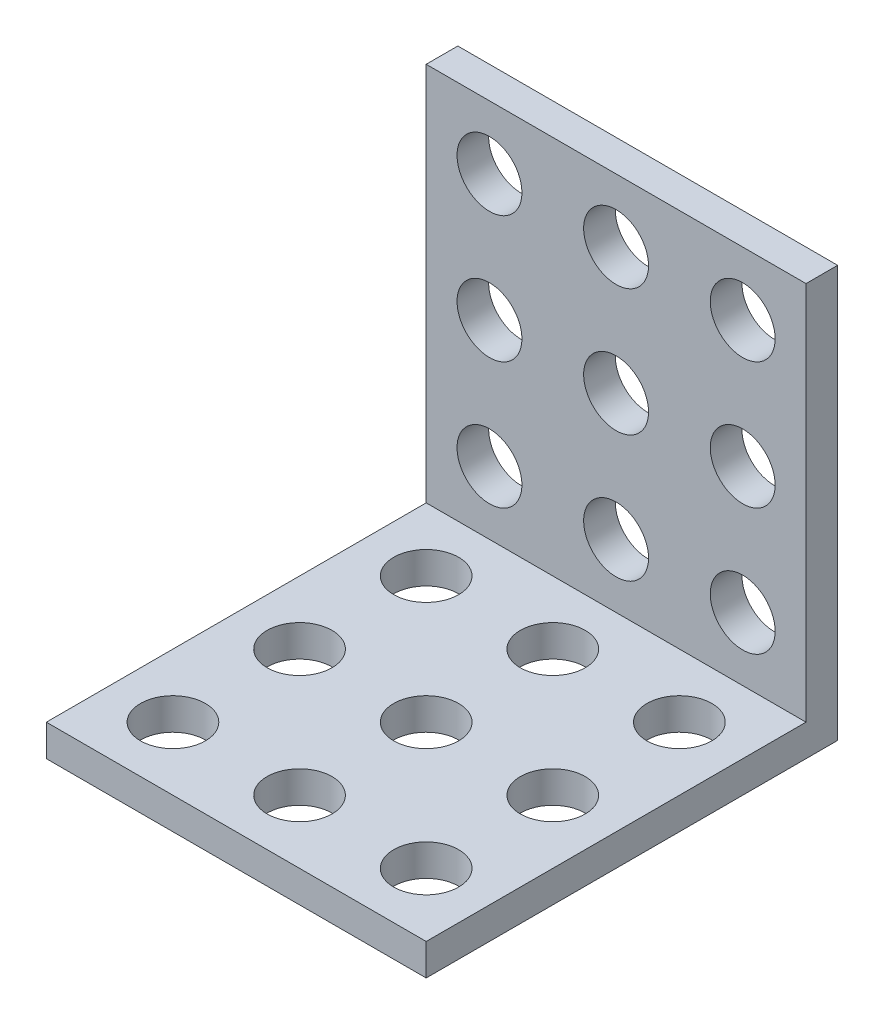
ISO-10303-21;
HEADER;
FILE_DESCRIPTION(('STEP AP214'),'2;1');
FILE_NAME('part.step','',(''),(''),'','','');
FILE_SCHEMA(('AUTOMOTIVE_DESIGN { 1 0 10303 214 1 1 1 1 }'));
ENDSEC;
DATA;
#1=APPLICATION_CONTEXT('core data for automotive mechanical design processes');
#2=APPLICATION_PROTOCOL_DEFINITION('international standard','automotive_design',2000,#1);
#3=PRODUCT_CONTEXT('',#1,'mechanical');
#4=PRODUCT('Part','Part','',(#3));
#5=PRODUCT_RELATED_PRODUCT_CATEGORY('part','',(#4));
#6=PRODUCT_DEFINITION_FORMATION('','',#4);
#7=PRODUCT_DEFINITION_CONTEXT('part definition',#1,'design');
#8=PRODUCT_DEFINITION('design','',#6,#7);
#9=PRODUCT_DEFINITION_SHAPE('','',#8);
#10=(LENGTH_UNIT() NAMED_UNIT(*) SI_UNIT(.MILLI.,.METRE.));
#11=(NAMED_UNIT(*) PLANE_ANGLE_UNIT() SI_UNIT($,.RADIAN.));
#12=(NAMED_UNIT(*) SI_UNIT($,.STERADIAN.) SOLID_ANGLE_UNIT());
#13=UNCERTAINTY_MEASURE_WITH_UNIT(LENGTH_MEASURE(1.E-05),#10,'distance_accuracy_value','');
#14=(GEOMETRIC_REPRESENTATION_CONTEXT(3) GLOBAL_UNCERTAINTY_ASSIGNED_CONTEXT((#13)) GLOBAL_UNIT_ASSIGNED_CONTEXT((#10,
#11,#12)) REPRESENTATION_CONTEXT('',''));
#15=CARTESIAN_POINT('',(0.,0.,0.));
#16=DIRECTION('',(0.,0.,1.));
#17=DIRECTION('',(1.,0.,0.));
#18=AXIS2_PLACEMENT_3D('',#15,#16,#17);
#19=CARTESIAN_POINT('',(12.,0.,26.));
#20=DIRECTION('',(0.,1.,0.));
#21=DIRECTION('',(0.,0.,1.));
#22=AXIS2_PLACEMENT_3D('',#19,#20,#21);
#23=PLANE('',#22);
#24=CARTESIAN_POINT('',(0.,0.,22.));
#25=DIRECTION('',(0.,1.,0.));
#26=DIRECTION('',(0.,0.,1.));
#27=AXIS2_PLACEMENT_3D('',#24,#25,#26);
#28=CIRCLE('',#27,2.05);
#29=CARTESIAN_POINT('',(0.,0.,24.05));
#30=VERTEX_POINT('',#29);
#31=EDGE_CURVE('E193',#30,#30,#28,.T.);
#32=ORIENTED_EDGE('',*,*,#31,.T.);
#33=EDGE_LOOP('',(#32));
#34=FACE_BOUND('',#33,.T.);
#35=CARTESIAN_POINT('',(8.00000000000003,0.,22.));
#36=DIRECTION('',(0.,1.,0.));
#37=DIRECTION('',(0.,0.,1.));
#38=AXIS2_PLACEMENT_3D('',#35,#36,#37);
#39=CIRCLE('',#38,2.05);
#40=CARTESIAN_POINT('',(8.00000000000003,0.,24.05));
#41=VERTEX_POINT('',#40);
#42=EDGE_CURVE('E197',#41,#41,#39,.T.);
#43=ORIENTED_EDGE('',*,*,#42,.T.);
#44=EDGE_LOOP('',(#43));
#45=FACE_BOUND('',#44,.T.);
#46=CARTESIAN_POINT('',(0.,0.,14.));
#47=DIRECTION('',(0.,1.,0.));
#48=DIRECTION('',(0.,0.,1.));
#49=AXIS2_PLACEMENT_3D('',#46,#47,#48);
#50=CIRCLE('',#49,2.05);
#51=CARTESIAN_POINT('',(0.,0.,16.05));
#52=VERTEX_POINT('',#51);
#53=EDGE_CURVE('E201',#52,#52,#50,.T.);
#54=ORIENTED_EDGE('',*,*,#53,.T.);
#55=EDGE_LOOP('',(#54));
#56=FACE_BOUND('',#55,.T.);
#57=CARTESIAN_POINT('',(8.,0.,14.));
#58=DIRECTION('',(0.,1.,0.));
#59=DIRECTION('',(0.,0.,1.));
#60=AXIS2_PLACEMENT_3D('',#57,#58,#59);
#61=CIRCLE('',#60,2.05);
#62=CARTESIAN_POINT('',(8.,0.,16.05));
#63=VERTEX_POINT('',#62);
#64=EDGE_CURVE('E205',#63,#63,#61,.T.);
#65=ORIENTED_EDGE('',*,*,#64,.T.);
#66=EDGE_LOOP('',(#65));
#67=FACE_BOUND('',#66,.T.);
#68=CARTESIAN_POINT('',(0.,0.,6.));
#69=DIRECTION('',(0.,1.,0.));
#70=DIRECTION('',(0.,0.,1.));
#71=AXIS2_PLACEMENT_3D('',#68,#69,#70);
#72=CIRCLE('',#71,2.05);
#73=CARTESIAN_POINT('',(0.,0.,8.05));
#74=VERTEX_POINT('',#73);
#75=EDGE_CURVE('E209',#74,#74,#72,.T.);
#76=ORIENTED_EDGE('',*,*,#75,.T.);
#77=EDGE_LOOP('',(#76));
#78=FACE_BOUND('',#77,.T.);
#79=CARTESIAN_POINT('',(7.99999999999997,0.,6.));
#80=DIRECTION('',(0.,1.,0.));
#81=DIRECTION('',(0.,0.,1.));
#82=AXIS2_PLACEMENT_3D('',#79,#80,#81);
#83=CIRCLE('',#82,2.05);
#84=CARTESIAN_POINT('',(7.99999999999997,0.,8.05));
#85=VERTEX_POINT('',#84);
#86=EDGE_CURVE('E213',#85,#85,#83,.T.);
#87=ORIENTED_EDGE('',*,*,#86,.T.);
#88=EDGE_LOOP('',(#87));
#89=FACE_BOUND('',#88,.T.);
#90=CARTESIAN_POINT('',(-8.,0.,14.));
#91=DIRECTION('',(0.,1.,0.));
#92=DIRECTION('',(0.,0.,1.));
#93=AXIS2_PLACEMENT_3D('',#90,#91,#92);
#94=CIRCLE('',#93,2.05);
#95=CARTESIAN_POINT('',(-8.,0.,16.05));
#96=VERTEX_POINT('',#95);
#97=EDGE_CURVE('E217',#96,#96,#94,.T.);
#98=ORIENTED_EDGE('',*,*,#97,.T.);
#99=EDGE_LOOP('',(#98));
#100=FACE_BOUND('',#99,.T.);
#101=CARTESIAN_POINT('',(-8.00000000000003,0.,6.));
#102=DIRECTION('',(0.,1.,0.));
#103=DIRECTION('',(0.,0.,1.));
#104=AXIS2_PLACEMENT_3D('',#101,#102,#103);
#105=CIRCLE('',#104,2.05);
#106=CARTESIAN_POINT('',(-8.00000000000003,0.,8.05));
#107=VERTEX_POINT('',#106);
#108=EDGE_CURVE('E221',#107,#107,#105,.T.);
#109=ORIENTED_EDGE('',*,*,#108,.T.);
#110=EDGE_LOOP('',(#109));
#111=FACE_BOUND('',#110,.T.);
#112=CARTESIAN_POINT('',(-7.99999999999997,0.,22.));
#113=DIRECTION('',(0.,1.,0.));
#114=DIRECTION('',(0.,0.,1.));
#115=AXIS2_PLACEMENT_3D('',#112,#113,#114);
#116=CIRCLE('',#115,2.05);
#117=CARTESIAN_POINT('',(-7.99999999999997,0.,24.05));
#118=VERTEX_POINT('',#117);
#119=EDGE_CURVE('E225',#118,#118,#116,.T.);
#120=ORIENTED_EDGE('',*,*,#119,.T.);
#121=EDGE_LOOP('',(#120));
#122=FACE_BOUND('',#121,.T.);
#123=DIRECTION('',(0.,0.,-1.));
#124=VECTOR('',#123,1.);
#125=CARTESIAN_POINT('',(-12.,0.,26.));
#126=LINE('',#125,#124);
#127=CARTESIAN_POINT('',(-12.,0.,26.));
#128=VERTEX_POINT('',#127);
#129=CARTESIAN_POINT('',(-12.,0.,0.));
#130=VERTEX_POINT('',#129);
#131=EDGE_CURVE('E119',#128,#130,#126,.T.);
#132=ORIENTED_EDGE('',*,*,#131,.T.);
#133=DIRECTION('',(-1.,0.,0.));
#134=VECTOR('',#133,1.);
#135=CARTESIAN_POINT('',(12.,0.,0.));
#136=LINE('',#135,#134);
#137=CARTESIAN_POINT('',(12.,0.,0.));
#138=VERTEX_POINT('',#137);
#139=EDGE_CURVE('E11',#138,#130,#136,.T.);
#140=ORIENTED_EDGE('',*,*,#139,.F.);
#141=DIRECTION('',(0.,0.,-1.));
#142=VECTOR('',#141,1.);
#143=CARTESIAN_POINT('',(12.,0.,26.));
#144=LINE('',#143,#142);
#145=CARTESIAN_POINT('',(12.,0.,26.));
#146=VERTEX_POINT('',#145);
#147=EDGE_CURVE('E129',#146,#138,#144,.T.);
#148=ORIENTED_EDGE('',*,*,#147,.F.);
#149=DIRECTION('',(-1.,0.,0.));
#150=VECTOR('',#149,1.);
#151=CARTESIAN_POINT('',(12.,0.,26.));
#152=LINE('',#151,#150);
#153=EDGE_CURVE('E115',#146,#128,#152,.T.);
#154=ORIENTED_EDGE('',*,*,#153,.T.);
#155=EDGE_LOOP('',(#132,#140,#148,#154));
#156=FACE_BOUND('',#155,.T.);
#157=ADVANCED_FACE('F33',(#34,#45,#56,#67,#78,#89,#100,#111,#122,#156),#23,.F.);
#158=CARTESIAN_POINT('',(12.,0.,0.));
#159=DIRECTION('',(0.,0.,1.));
#160=DIRECTION('',(1.,0.,0.));
#161=AXIS2_PLACEMENT_3D('',#158,#159,#160);
#162=PLANE('',#161);
#163=CARTESIAN_POINT('',(0.,22.,0.));
#164=DIRECTION('',(0.,0.,1.));
#165=DIRECTION('',(1.,0.,0.));
#166=AXIS2_PLACEMENT_3D('',#163,#164,#165);
#167=CIRCLE('',#166,2.05);
#168=CARTESIAN_POINT('',(2.04999999999992,22.,0.));
#169=VERTEX_POINT('',#168);
#170=EDGE_CURVE('E238',#169,#169,#167,.T.);
#171=ORIENTED_EDGE('',*,*,#170,.T.);
#172=EDGE_LOOP('',(#171));
#173=FACE_BOUND('',#172,.T.);
#174=CARTESIAN_POINT('',(7.99999999999992,22.,0.));
#175=DIRECTION('',(0.,0.,1.));
#176=DIRECTION('',(1.,0.,0.));
#177=AXIS2_PLACEMENT_3D('',#174,#175,#176);
#178=CIRCLE('',#177,2.05);
#179=CARTESIAN_POINT('',(10.0499999999999,22.,0.));
#180=VERTEX_POINT('',#179);
#181=EDGE_CURVE('E246',#180,#180,#178,.T.);
#182=ORIENTED_EDGE('',*,*,#181,.T.);
#183=EDGE_LOOP('',(#182));
#184=FACE_BOUND('',#183,.T.);
#185=CARTESIAN_POINT('',(0.,14.,0.));
#186=DIRECTION('',(0.,0.,1.));
#187=DIRECTION('',(1.,0.,0.));
#188=AXIS2_PLACEMENT_3D('',#185,#186,#187);
#189=CIRCLE('',#188,2.05);
#190=CARTESIAN_POINT('',(2.05,14.,0.));
#191=VERTEX_POINT('',#190);
#192=EDGE_CURVE('E242',#191,#191,#189,.T.);
#193=ORIENTED_EDGE('',*,*,#192,.T.);
#194=EDGE_LOOP('',(#193));
#195=FACE_BOUND('',#194,.T.);
#196=CARTESIAN_POINT('',(8.,14.,0.));
#197=DIRECTION('',(0.,0.,1.));
#198=DIRECTION('',(1.,0.,0.));
#199=AXIS2_PLACEMENT_3D('',#196,#197,#198);
#200=CIRCLE('',#199,2.05);
#201=CARTESIAN_POINT('',(10.05,14.,0.));
#202=VERTEX_POINT('',#201);
#203=EDGE_CURVE('E239',#202,#202,#200,.T.);
#204=ORIENTED_EDGE('',*,*,#203,.T.);
#205=EDGE_LOOP('',(#204));
#206=FACE_BOUND('',#205,.T.);
#207=CARTESIAN_POINT('',(0.,6.,0.));
#208=DIRECTION('',(0.,0.,1.));
#209=DIRECTION('',(1.,0.,0.));
#210=AXIS2_PLACEMENT_3D('',#207,#208,#209);
#211=CIRCLE('',#210,2.05);
#212=CARTESIAN_POINT('',(2.05000000000008,6.,0.));
#213=VERTEX_POINT('',#212);
#214=EDGE_CURVE('E243',#213,#213,#211,.T.);
#215=ORIENTED_EDGE('',*,*,#214,.T.);
#216=EDGE_LOOP('',(#215));
#217=FACE_BOUND('',#216,.T.);
#218=CARTESIAN_POINT('',(8.00000000000008,6.,0.));
#219=DIRECTION('',(0.,0.,1.));
#220=DIRECTION('',(1.,0.,0.));
#221=AXIS2_PLACEMENT_3D('',#218,#219,#220);
#222=CIRCLE('',#221,2.05);
#223=CARTESIAN_POINT('',(10.0500000000001,6.,0.));
#224=VERTEX_POINT('',#223);
#225=EDGE_CURVE('E257',#224,#224,#222,.T.);
#226=ORIENTED_EDGE('',*,*,#225,.T.);
#227=EDGE_LOOP('',(#226));
#228=FACE_BOUND('',#227,.T.);
#229=CARTESIAN_POINT('',(-8.,14.,0.));
#230=DIRECTION('',(0.,0.,1.));
#231=DIRECTION('',(1.,0.,0.));
#232=AXIS2_PLACEMENT_3D('',#229,#230,#231);
#233=CIRCLE('',#232,2.05);
#234=CARTESIAN_POINT('',(-5.95,14.,0.));
#235=VERTEX_POINT('',#234);
#236=EDGE_CURVE('E254',#235,#235,#233,.T.);
#237=ORIENTED_EDGE('',*,*,#236,.T.);
#238=EDGE_LOOP('',(#237));
#239=FACE_BOUND('',#238,.T.);
#240=CARTESIAN_POINT('',(-7.99999999999991,6.,0.));
#241=DIRECTION('',(0.,0.,1.));
#242=DIRECTION('',(1.,0.,0.));
#243=AXIS2_PLACEMENT_3D('',#240,#241,#242);
#244=CIRCLE('',#243,2.05);
#245=CARTESIAN_POINT('',(-5.94999999999992,6.,0.));
#246=VERTEX_POINT('',#245);
#247=EDGE_CURVE('E251',#246,#246,#244,.T.);
#248=ORIENTED_EDGE('',*,*,#247,.T.);
#249=EDGE_LOOP('',(#248));
#250=FACE_BOUND('',#249,.T.);
#251=CARTESIAN_POINT('',(-8.00000000000008,22.,0.));
#252=DIRECTION('',(0.,0.,1.));
#253=DIRECTION('',(1.,0.,0.));
#254=AXIS2_PLACEMENT_3D('',#251,#252,#253);
#255=CIRCLE('',#254,2.05);
#256=CARTESIAN_POINT('',(-5.95000000000008,22.,0.));
#257=VERTEX_POINT('',#256);
#258=EDGE_CURVE('E139',#257,#257,#255,.T.);
#259=ORIENTED_EDGE('',*,*,#258,.T.);
#260=EDGE_LOOP('',(#259));
#261=FACE_BOUND('',#260,.T.);
#262=DIRECTION('',(0.,1.,0.));
#263=VECTOR('',#262,1.);
#264=CARTESIAN_POINT('',(-12.,0.,0.));
#265=LINE('',#264,#263);
#266=CARTESIAN_POINT('',(-12.,26.,0.));
#267=VERTEX_POINT('',#266);
#268=EDGE_CURVE('E122',#130,#267,#265,.T.);
#269=ORIENTED_EDGE('',*,*,#268,.T.);
#270=DIRECTION('',(-1.,0.,0.));
#271=VECTOR('',#270,1.);
#272=CARTESIAN_POINT('',(12.,26.,0.));
#273=LINE('',#272,#271);
#274=CARTESIAN_POINT('',(12.,26.,0.));
#275=VERTEX_POINT('',#274);
#276=EDGE_CURVE('E42',#275,#267,#273,.T.);
#277=ORIENTED_EDGE('',*,*,#276,.F.);
#278=DIRECTION('',(0.,1.,0.));
#279=VECTOR('',#278,1.);
#280=CARTESIAN_POINT('',(12.,0.,0.));
#281=LINE('',#280,#279);
#282=EDGE_CURVE('E88',#138,#275,#281,.T.);
#283=ORIENTED_EDGE('',*,*,#282,.F.);
#284=ORIENTED_EDGE('',*,*,#139,.T.);
#285=EDGE_LOOP('',(#269,#277,#283,#284));
#286=FACE_BOUND('',#285,.T.);
#287=ADVANCED_FACE('F183',(#173,#184,#195,#206,#217,#228,#239,#250,#261,#286),#162,.F.);
#288=CARTESIAN_POINT('',(12.,26.,0.));
#289=DIRECTION('',(0.,-1.,0.));
#290=DIRECTION('',(0.,0.,-1.));
#291=AXIS2_PLACEMENT_3D('',#288,#289,#290);
#292=PLANE('',#291);
#293=DIRECTION('',(0.,0.,1.));
#294=VECTOR('',#293,1.);
#295=CARTESIAN_POINT('',(-12.,26.,0.));
#296=LINE('',#295,#294);
#297=CARTESIAN_POINT('',(-12.,26.,2.));
#298=VERTEX_POINT('',#297);
#299=EDGE_CURVE('E124',#267,#298,#296,.T.);
#300=ORIENTED_EDGE('',*,*,#299,.T.);
#301=DIRECTION('',(-1.,0.,0.));
#302=VECTOR('',#301,1.);
#303=CARTESIAN_POINT('',(12.,26.,2.));
#304=LINE('',#303,#302);
#305=CARTESIAN_POINT('',(12.,26.,2.));
#306=VERTEX_POINT('',#305);
#307=EDGE_CURVE('E110',#306,#298,#304,.T.);
#308=ORIENTED_EDGE('',*,*,#307,.F.);
#309=DIRECTION('',(0.,0.,1.));
#310=VECTOR('',#309,1.);
#311=CARTESIAN_POINT('',(12.,26.,0.));
#312=LINE('',#311,#310);
#313=EDGE_CURVE('E101',#275,#306,#312,.T.);
#314=ORIENTED_EDGE('',*,*,#313,.F.);
#315=ORIENTED_EDGE('',*,*,#276,.T.);
#316=EDGE_LOOP('',(#300,#308,#314,#315));
#317=FACE_BOUND('',#316,.T.);
#318=ADVANCED_FACE('F188',(#317),#292,.F.);
#319=CARTESIAN_POINT('',(12.,26.,2.));
#320=DIRECTION('',(0.,0.,-1.));
#321=DIRECTION('',(0.,1.,0.));
#322=AXIS2_PLACEMENT_3D('',#319,#320,#321);
#323=PLANE('',#322);
#324=CARTESIAN_POINT('',(0.,22.,2.));
#325=DIRECTION('',(0.,0.,-1.));
#326=DIRECTION('',(0.,1.,0.));
#327=AXIS2_PLACEMENT_3D('',#324,#325,#326);
#328=CIRCLE('',#327,2.05);
#329=CARTESIAN_POINT('',(0.,24.05,2.));
#330=VERTEX_POINT('',#329);
#331=EDGE_CURVE('E36',#330,#330,#328,.T.);
#332=ORIENTED_EDGE('',*,*,#331,.T.);
#333=EDGE_LOOP('',(#332));
#334=FACE_BOUND('',#333,.T.);
#335=CARTESIAN_POINT('',(7.99999999999992,22.,2.));
#336=DIRECTION('',(0.,0.,-1.));
#337=DIRECTION('',(0.,1.,0.));
#338=AXIS2_PLACEMENT_3D('',#335,#336,#337);
#339=CIRCLE('',#338,2.05);
#340=CARTESIAN_POINT('',(7.99999999999992,24.05,2.));
#341=VERTEX_POINT('',#340);
#342=EDGE_CURVE('E156',#341,#341,#339,.T.);
#343=ORIENTED_EDGE('',*,*,#342,.T.);
#344=EDGE_LOOP('',(#343));
#345=FACE_BOUND('',#344,.T.);
#346=CARTESIAN_POINT('',(0.,14.,2.));
#347=DIRECTION('',(0.,0.,-1.));
#348=DIRECTION('',(0.,1.,0.));
#349=AXIS2_PLACEMENT_3D('',#346,#347,#348);
#350=CIRCLE('',#349,2.05);
#351=CARTESIAN_POINT('',(0.,16.05,2.));
#352=VERTEX_POINT('',#351);
#353=EDGE_CURVE('E154',#352,#352,#350,.T.);
#354=ORIENTED_EDGE('',*,*,#353,.T.);
#355=EDGE_LOOP('',(#354));
#356=FACE_BOUND('',#355,.T.);
#357=CARTESIAN_POINT('',(8.,14.,2.));
#358=DIRECTION('',(0.,0.,-1.));
#359=DIRECTION('',(0.,1.,0.));
#360=AXIS2_PLACEMENT_3D('',#357,#358,#359);
#361=CIRCLE('',#360,2.05);
#362=CARTESIAN_POINT('',(8.,16.05,2.));
#363=VERTEX_POINT('',#362);
#364=EDGE_CURVE('E151',#363,#363,#361,.T.);
#365=ORIENTED_EDGE('',*,*,#364,.T.);
#366=EDGE_LOOP('',(#365));
#367=FACE_BOUND('',#366,.T.);
#368=CARTESIAN_POINT('',(0.,6.,2.));
#369=DIRECTION('',(0.,0.,-1.));
#370=DIRECTION('',(0.,1.,0.));
#371=AXIS2_PLACEMENT_3D('',#368,#369,#370);
#372=CIRCLE('',#371,2.05);
#373=CARTESIAN_POINT('',(0.,8.05,2.));
#374=VERTEX_POINT('',#373);
#375=EDGE_CURVE('E148',#374,#374,#372,.T.);
#376=ORIENTED_EDGE('',*,*,#375,.T.);
#377=EDGE_LOOP('',(#376));
#378=FACE_BOUND('',#377,.T.);
#379=CARTESIAN_POINT('',(8.00000000000008,6.,2.));
#380=DIRECTION('',(0.,0.,-1.));
#381=DIRECTION('',(0.,1.,0.));
#382=AXIS2_PLACEMENT_3D('',#379,#380,#381);
#383=CIRCLE('',#382,2.05);
#384=CARTESIAN_POINT('',(8.00000000000008,8.05,2.));
#385=VERTEX_POINT('',#384);
#386=EDGE_CURVE('E145',#385,#385,#383,.T.);
#387=ORIENTED_EDGE('',*,*,#386,.T.);
#388=EDGE_LOOP('',(#387));
#389=FACE_BOUND('',#388,.T.);
#390=CARTESIAN_POINT('',(-8.,14.,2.));
#391=DIRECTION('',(0.,0.,-1.));
#392=DIRECTION('',(0.,1.,0.));
#393=AXIS2_PLACEMENT_3D('',#390,#391,#392);
#394=CIRCLE('',#393,2.05);
#395=CARTESIAN_POINT('',(-8.,16.05,2.));
#396=VERTEX_POINT('',#395);
#397=EDGE_CURVE('E142',#396,#396,#394,.T.);
#398=ORIENTED_EDGE('',*,*,#397,.T.);
#399=EDGE_LOOP('',(#398));
#400=FACE_BOUND('',#399,.T.);
#401=CARTESIAN_POINT('',(-7.99999999999991,6.,2.));
#402=DIRECTION('',(0.,0.,-1.));
#403=DIRECTION('',(0.,1.,0.));
#404=AXIS2_PLACEMENT_3D('',#401,#402,#403);
#405=CIRCLE('',#404,2.05);
#406=CARTESIAN_POINT('',(-7.99999999999991,8.05,2.));
#407=VERTEX_POINT('',#406);
#408=EDGE_CURVE('E138',#407,#407,#405,.T.);
#409=ORIENTED_EDGE('',*,*,#408,.T.);
#410=EDGE_LOOP('',(#409));
#411=FACE_BOUND('',#410,.T.);
#412=CARTESIAN_POINT('',(-8.00000000000008,22.,2.));
#413=DIRECTION('',(0.,0.,-1.));
#414=DIRECTION('',(0.,1.,0.));
#415=AXIS2_PLACEMENT_3D('',#412,#413,#414);
#416=CIRCLE('',#415,2.05);
#417=CARTESIAN_POINT('',(-8.00000000000008,24.05,2.));
#418=VERTEX_POINT('',#417);
#419=EDGE_CURVE('E135',#418,#418,#416,.T.);
#420=ORIENTED_EDGE('',*,*,#419,.T.);
#421=EDGE_LOOP('',(#420));
#422=FACE_BOUND('',#421,.T.);
#423=DIRECTION('',(0.,-1.,0.));
#424=VECTOR('',#423,1.);
#425=CARTESIAN_POINT('',(-12.,26.,2.));
#426=LINE('',#425,#424);
#427=CARTESIAN_POINT('',(-12.,2.,2.));
#428=VERTEX_POINT('',#427);
#429=EDGE_CURVE('E109',#298,#428,#426,.T.);
#430=ORIENTED_EDGE('',*,*,#429,.T.);
#431=DIRECTION('',(-1.,0.,0.));
#432=VECTOR('',#431,1.);
#433=CARTESIAN_POINT('',(12.,2.,2.));
#434=LINE('',#433,#432);
#435=CARTESIAN_POINT('',(12.,2.,2.));
#436=VERTEX_POINT('',#435);
#437=EDGE_CURVE('E106',#436,#428,#434,.T.);
#438=ORIENTED_EDGE('',*,*,#437,.F.);
#439=DIRECTION('',(0.,-1.,0.));
#440=VECTOR('',#439,1.);
#441=CARTESIAN_POINT('',(12.,26.,2.));
#442=LINE('',#441,#440);
#443=EDGE_CURVE('E95',#306,#436,#442,.T.);
#444=ORIENTED_EDGE('',*,*,#443,.F.);
#445=ORIENTED_EDGE('',*,*,#307,.T.);
#446=EDGE_LOOP('',(#430,#438,#444,#445));
#447=FACE_BOUND('',#446,.T.);
#448=ADVANCED_FACE('F107',(#334,#345,#356,#367,#378,#389,#400,#411,#422,#447),#323,.F.);
#449=CARTESIAN_POINT('',(12.,2.,2.));
#450=DIRECTION('',(0.,-1.,0.));
#451=DIRECTION('',(0.,0.,-1.));
#452=AXIS2_PLACEMENT_3D('',#449,#450,#451);
#453=PLANE('',#452);
#454=CARTESIAN_POINT('',(0.,2.,22.));
#455=DIRECTION('',(0.,1.,0.));
#456=DIRECTION('',(0.,0.,1.));
#457=AXIS2_PLACEMENT_3D('',#454,#455,#456);
#458=CIRCLE('',#457,2.05);
#459=CARTESIAN_POINT('',(0.,2.,24.05));
#460=VERTEX_POINT('',#459);
#461=EDGE_CURVE('E278',#460,#460,#458,.T.);
#462=ORIENTED_EDGE('',*,*,#461,.F.);
#463=EDGE_LOOP('',(#462));
#464=FACE_BOUND('',#463,.T.);
#465=CARTESIAN_POINT('',(8.00000000000003,2.,22.));
#466=DIRECTION('',(0.,1.,0.));
#467=DIRECTION('',(0.,0.,1.));
#468=AXIS2_PLACEMENT_3D('',#465,#466,#467);
#469=CIRCLE('',#468,2.05);
#470=CARTESIAN_POINT('',(8.00000000000003,2.,24.05));
#471=VERTEX_POINT('',#470);
#472=EDGE_CURVE('E274',#471,#471,#469,.T.);
#473=ORIENTED_EDGE('',*,*,#472,.F.);
#474=EDGE_LOOP('',(#473));
#475=FACE_BOUND('',#474,.T.);
#476=CARTESIAN_POINT('',(0.,2.,14.));
#477=DIRECTION('',(0.,1.,0.));
#478=DIRECTION('',(0.,0.,1.));
#479=AXIS2_PLACEMENT_3D('',#476,#477,#478);
#480=CIRCLE('',#479,2.05);
#481=CARTESIAN_POINT('',(0.,2.,16.05));
#482=VERTEX_POINT('',#481);
#483=EDGE_CURVE('E270',#482,#482,#480,.T.);
#484=ORIENTED_EDGE('',*,*,#483,.F.);
#485=EDGE_LOOP('',(#484));
#486=FACE_BOUND('',#485,.T.);
#487=CARTESIAN_POINT('',(8.,2.,14.));
#488=DIRECTION('',(0.,1.,0.));
#489=DIRECTION('',(0.,0.,1.));
#490=AXIS2_PLACEMENT_3D('',#487,#488,#489);
#491=CIRCLE('',#490,2.05);
#492=CARTESIAN_POINT('',(8.,2.,16.05));
#493=VERTEX_POINT('',#492);
#494=EDGE_CURVE('E266',#493,#493,#491,.T.);
#495=ORIENTED_EDGE('',*,*,#494,.F.);
#496=EDGE_LOOP('',(#495));
#497=FACE_BOUND('',#496,.T.);
#498=CARTESIAN_POINT('',(0.,2.,6.));
#499=DIRECTION('',(0.,1.,0.));
#500=DIRECTION('',(0.,0.,1.));
#501=AXIS2_PLACEMENT_3D('',#498,#499,#500);
#502=CIRCLE('',#501,2.05);
#503=CARTESIAN_POINT('',(0.,2.,8.05));
#504=VERTEX_POINT('',#503);
#505=EDGE_CURVE('E294',#504,#504,#502,.T.);
#506=ORIENTED_EDGE('',*,*,#505,.F.);
#507=EDGE_LOOP('',(#506));
#508=FACE_BOUND('',#507,.T.);
#509=CARTESIAN_POINT('',(7.99999999999997,2.,6.));
#510=DIRECTION('',(0.,1.,0.));
#511=DIRECTION('',(0.,0.,1.));
#512=AXIS2_PLACEMENT_3D('',#509,#510,#511);
#513=CIRCLE('',#512,2.05);
#514=CARTESIAN_POINT('',(7.99999999999997,2.,8.05));
#515=VERTEX_POINT('',#514);
#516=EDGE_CURVE('E290',#515,#515,#513,.T.);
#517=ORIENTED_EDGE('',*,*,#516,.F.);
#518=EDGE_LOOP('',(#517));
#519=FACE_BOUND('',#518,.T.);
#520=CARTESIAN_POINT('',(-8.,2.,14.));
#521=DIRECTION('',(0.,1.,0.));
#522=DIRECTION('',(0.,0.,1.));
#523=AXIS2_PLACEMENT_3D('',#520,#521,#522);
#524=CIRCLE('',#523,2.05);
#525=CARTESIAN_POINT('',(-8.,2.,16.05));
#526=VERTEX_POINT('',#525);
#527=EDGE_CURVE('E286',#526,#526,#524,.T.);
#528=ORIENTED_EDGE('',*,*,#527,.F.);
#529=EDGE_LOOP('',(#528));
#530=FACE_BOUND('',#529,.T.);
#531=CARTESIAN_POINT('',(-8.00000000000003,2.,6.));
#532=DIRECTION('',(0.,1.,0.));
#533=DIRECTION('',(0.,0.,1.));
#534=AXIS2_PLACEMENT_3D('',#531,#532,#533);
#535=CIRCLE('',#534,2.05);
#536=CARTESIAN_POINT('',(-8.00000000000003,2.,8.05));
#537=VERTEX_POINT('',#536);
#538=EDGE_CURVE('E282',#537,#537,#535,.T.);
#539=ORIENTED_EDGE('',*,*,#538,.F.);
#540=EDGE_LOOP('',(#539));
#541=FACE_BOUND('',#540,.T.);
#542=CARTESIAN_POINT('',(-7.99999999999997,2.,22.));
#543=DIRECTION('',(0.,1.,0.));
#544=DIRECTION('',(0.,0.,1.));
#545=AXIS2_PLACEMENT_3D('',#542,#543,#544);
#546=CIRCLE('',#545,2.05);
#547=CARTESIAN_POINT('',(-7.99999999999997,2.,24.05));
#548=VERTEX_POINT('',#547);
#549=EDGE_CURVE('E262',#548,#548,#546,.T.);
#550=ORIENTED_EDGE('',*,*,#549,.F.);
#551=EDGE_LOOP('',(#550));
#552=FACE_BOUND('',#551,.T.);
#553=DIRECTION('',(0.,0.,1.));
#554=VECTOR('',#553,1.);
#555=CARTESIAN_POINT('',(-12.,2.,2.));
#556=LINE('',#555,#554);
#557=CARTESIAN_POINT('',(-12.,2.,26.));
#558=VERTEX_POINT('',#557);
#559=EDGE_CURVE('E74',#428,#558,#556,.T.);
#560=ORIENTED_EDGE('',*,*,#559,.T.);
#561=DIRECTION('',(-1.,0.,0.));
#562=VECTOR('',#561,1.);
#563=CARTESIAN_POINT('',(12.,2.,26.));
#564=LINE('',#563,#562);
#565=CARTESIAN_POINT('',(12.,2.,26.));
#566=VERTEX_POINT('',#565);
#567=EDGE_CURVE('E111',#566,#558,#564,.T.);
#568=ORIENTED_EDGE('',*,*,#567,.F.);
#569=DIRECTION('',(0.,0.,1.));
#570=VECTOR('',#569,1.);
#571=CARTESIAN_POINT('',(12.,2.,2.));
#572=LINE('',#571,#570);
#573=EDGE_CURVE('E99',#436,#566,#572,.T.);
#574=ORIENTED_EDGE('',*,*,#573,.F.);
#575=ORIENTED_EDGE('',*,*,#437,.T.);
#576=EDGE_LOOP('',(#560,#568,#574,#575));
#577=FACE_BOUND('',#576,.T.);
#578=ADVANCED_FACE('F113',(#464,#475,#486,#497,#508,#519,#530,#541,#552,#577),#453,.F.);
#579=CARTESIAN_POINT('',(12.,2.,26.));
#580=DIRECTION('',(0.,0.,-1.));
#581=DIRECTION('',(-1.,0.,0.));
#582=AXIS2_PLACEMENT_3D('',#579,#580,#581);
#583=PLANE('',#582);
#584=DIRECTION('',(0.,-1.,0.));
#585=VECTOR('',#584,1.);
#586=CARTESIAN_POINT('',(-12.,2.,26.));
#587=LINE('',#586,#585);
#588=EDGE_CURVE('E80',#558,#128,#587,.T.);
#589=ORIENTED_EDGE('',*,*,#588,.T.);
#590=ORIENTED_EDGE('',*,*,#153,.F.);
#591=DIRECTION('',(0.,-1.,0.));
#592=VECTOR('',#591,1.);
#593=CARTESIAN_POINT('',(12.,2.,26.));
#594=LINE('',#593,#592);
#595=EDGE_CURVE('E51',#566,#146,#594,.T.);
#596=ORIENTED_EDGE('',*,*,#595,.F.);
#597=ORIENTED_EDGE('',*,*,#567,.T.);
#598=EDGE_LOOP('',(#589,#590,#596,#597));
#599=FACE_BOUND('',#598,.T.);
#600=ADVANCED_FACE('F303',(#599),#583,.F.);
#601=CARTESIAN_POINT('',(12.,0.,0.));
#602=DIRECTION('',(1.,0.,0.));
#603=DIRECTION('',(0.,0.,-1.));
#604=AXIS2_PLACEMENT_3D('',#601,#602,#603);
#605=PLANE('',#604);
#606=ORIENTED_EDGE('',*,*,#147,.T.);
#607=ORIENTED_EDGE('',*,*,#282,.T.);
#608=ORIENTED_EDGE('',*,*,#313,.T.);
#609=ORIENTED_EDGE('',*,*,#443,.T.);
#610=ORIENTED_EDGE('',*,*,#573,.T.);
#611=ORIENTED_EDGE('',*,*,#595,.T.);
#612=EDGE_LOOP('',(#606,#607,#608,#609,#610,#611));
#613=FACE_BOUND('',#612,.T.);
#614=ADVANCED_FACE('F97',(#613),#605,.T.);
#615=CARTESIAN_POINT('',(-12.,0.,0.));
#616=DIRECTION('',(1.,0.,0.));
#617=DIRECTION('',(0.,0.,-1.));
#618=AXIS2_PLACEMENT_3D('',#615,#616,#617);
#619=PLANE('',#618);
#620=ORIENTED_EDGE('',*,*,#131,.F.);
#621=ORIENTED_EDGE('',*,*,#588,.F.);
#622=ORIENTED_EDGE('',*,*,#559,.F.);
#623=ORIENTED_EDGE('',*,*,#429,.F.);
#624=ORIENTED_EDGE('',*,*,#299,.F.);
#625=ORIENTED_EDGE('',*,*,#268,.F.);
#626=EDGE_LOOP('',(#620,#621,#622,#623,#624,#625));
#627=FACE_BOUND('',#626,.T.);
#628=ADVANCED_FACE('F230',(#627),#619,.F.);
#629=CARTESIAN_POINT('',(-8.00000000000008,22.,0.));
#630=DIRECTION('',(0.,0.,1.));
#631=DIRECTION('',(1.,0.,0.));
#632=AXIS2_PLACEMENT_3D('',#629,#630,#631);
#633=CYLINDRICAL_SURFACE('',#632,2.05);
#634=ORIENTED_EDGE('',*,*,#258,.F.);
#635=EDGE_LOOP('',(#634));
#636=FACE_BOUND('',#635,.T.);
#637=ORIENTED_EDGE('',*,*,#419,.F.);
#638=EDGE_LOOP('',(#637));
#639=FACE_BOUND('',#638,.T.);
#640=ADVANCED_FACE('F357',(#636,#639),#633,.F.);
#641=CARTESIAN_POINT('',(-7.99999999999991,6.,0.));
#642=DIRECTION('',(0.,0.,1.));
#643=DIRECTION('',(1.,0.,0.));
#644=AXIS2_PLACEMENT_3D('',#641,#642,#643);
#645=CYLINDRICAL_SURFACE('',#644,2.05);
#646=ORIENTED_EDGE('',*,*,#247,.F.);
#647=EDGE_LOOP('',(#646));
#648=FACE_BOUND('',#647,.T.);
#649=ORIENTED_EDGE('',*,*,#408,.F.);
#650=EDGE_LOOP('',(#649));
#651=FACE_BOUND('',#650,.T.);
#652=ADVANCED_FACE('F354',(#648,#651),#645,.F.);
#653=CARTESIAN_POINT('',(-8.,14.,0.));
#654=DIRECTION('',(0.,0.,1.));
#655=DIRECTION('',(1.,0.,0.));
#656=AXIS2_PLACEMENT_3D('',#653,#654,#655);
#657=CYLINDRICAL_SURFACE('',#656,2.05);
#658=ORIENTED_EDGE('',*,*,#236,.F.);
#659=EDGE_LOOP('',(#658));
#660=FACE_BOUND('',#659,.T.);
#661=ORIENTED_EDGE('',*,*,#397,.F.);
#662=EDGE_LOOP('',(#661));
#663=FACE_BOUND('',#662,.T.);
#664=ADVANCED_FACE('F351',(#660,#663),#657,.F.);
#665=CARTESIAN_POINT('',(8.00000000000008,6.,0.));
#666=DIRECTION('',(0.,0.,1.));
#667=DIRECTION('',(1.,0.,0.));
#668=AXIS2_PLACEMENT_3D('',#665,#666,#667);
#669=CYLINDRICAL_SURFACE('',#668,2.05);
#670=ORIENTED_EDGE('',*,*,#225,.F.);
#671=EDGE_LOOP('',(#670));
#672=FACE_BOUND('',#671,.T.);
#673=ORIENTED_EDGE('',*,*,#386,.F.);
#674=EDGE_LOOP('',(#673));
#675=FACE_BOUND('',#674,.T.);
#676=ADVANCED_FACE('F347',(#672,#675),#669,.F.);
#677=CARTESIAN_POINT('',(0.,6.,0.));
#678=DIRECTION('',(0.,0.,1.));
#679=DIRECTION('',(1.,0.,0.));
#680=AXIS2_PLACEMENT_3D('',#677,#678,#679);
#681=CYLINDRICAL_SURFACE('',#680,2.05);
#682=ORIENTED_EDGE('',*,*,#214,.F.);
#683=EDGE_LOOP('',(#682));
#684=FACE_BOUND('',#683,.T.);
#685=ORIENTED_EDGE('',*,*,#375,.F.);
#686=EDGE_LOOP('',(#685));
#687=FACE_BOUND('',#686,.T.);
#688=ADVANCED_FACE('F343',(#684,#687),#681,.F.);
#689=CARTESIAN_POINT('',(8.,14.,0.));
#690=DIRECTION('',(0.,0.,1.));
#691=DIRECTION('',(1.,0.,0.));
#692=AXIS2_PLACEMENT_3D('',#689,#690,#691);
#693=CYLINDRICAL_SURFACE('',#692,2.05);
#694=ORIENTED_EDGE('',*,*,#203,.F.);
#695=EDGE_LOOP('',(#694));
#696=FACE_BOUND('',#695,.T.);
#697=ORIENTED_EDGE('',*,*,#364,.F.);
#698=EDGE_LOOP('',(#697));
#699=FACE_BOUND('',#698,.T.);
#700=ADVANCED_FACE('F346',(#696,#699),#693,.F.);
#701=CARTESIAN_POINT('',(0.,14.,0.));
#702=DIRECTION('',(0.,0.,1.));
#703=DIRECTION('',(1.,0.,0.));
#704=AXIS2_PLACEMENT_3D('',#701,#702,#703);
#705=CYLINDRICAL_SURFACE('',#704,2.05);
#706=ORIENTED_EDGE('',*,*,#192,.F.);
#707=EDGE_LOOP('',(#706));
#708=FACE_BOUND('',#707,.T.);
#709=ORIENTED_EDGE('',*,*,#353,.F.);
#710=EDGE_LOOP('',(#709));
#711=FACE_BOUND('',#710,.T.);
#712=ADVANCED_FACE('F177',(#708,#711),#705,.F.);
#713=CARTESIAN_POINT('',(7.99999999999992,22.,0.));
#714=DIRECTION('',(0.,0.,1.));
#715=DIRECTION('',(1.,0.,0.));
#716=AXIS2_PLACEMENT_3D('',#713,#714,#715);
#717=CYLINDRICAL_SURFACE('',#716,2.05);
#718=ORIENTED_EDGE('',*,*,#181,.F.);
#719=EDGE_LOOP('',(#718));
#720=FACE_BOUND('',#719,.T.);
#721=ORIENTED_EDGE('',*,*,#342,.F.);
#722=EDGE_LOOP('',(#721));
#723=FACE_BOUND('',#722,.T.);
#724=ADVANCED_FACE('F167',(#720,#723),#717,.F.);
#725=CARTESIAN_POINT('',(0.,22.,0.));
#726=DIRECTION('',(0.,0.,1.));
#727=DIRECTION('',(1.,0.,0.));
#728=AXIS2_PLACEMENT_3D('',#725,#726,#727);
#729=CYLINDRICAL_SURFACE('',#728,2.05);
#730=ORIENTED_EDGE('',*,*,#170,.F.);
#731=EDGE_LOOP('',(#730));
#732=FACE_BOUND('',#731,.T.);
#733=ORIENTED_EDGE('',*,*,#331,.F.);
#734=EDGE_LOOP('',(#733));
#735=FACE_BOUND('',#734,.T.);
#736=ADVANCED_FACE('F164',(#732,#735),#729,.F.);
#737=CARTESIAN_POINT('',(-7.99999999999997,0.,22.));
#738=DIRECTION('',(0.,1.,0.));
#739=DIRECTION('',(0.,0.,1.));
#740=AXIS2_PLACEMENT_3D('',#737,#738,#739);
#741=CYLINDRICAL_SURFACE('',#740,2.05);
#742=ORIENTED_EDGE('',*,*,#119,.F.);
#743=EDGE_LOOP('',(#742));
#744=FACE_BOUND('',#743,.T.);
#745=ORIENTED_EDGE('',*,*,#549,.T.);
#746=EDGE_LOOP('',(#745));
#747=FACE_BOUND('',#746,.T.);
#748=ADVANCED_FACE('F166',(#744,#747),#741,.F.);
#749=CARTESIAN_POINT('',(-8.00000000000003,0.,6.));
#750=DIRECTION('',(0.,1.,0.));
#751=DIRECTION('',(0.,0.,1.));
#752=AXIS2_PLACEMENT_3D('',#749,#750,#751);
#753=CYLINDRICAL_SURFACE('',#752,2.05);
#754=ORIENTED_EDGE('',*,*,#108,.F.);
#755=EDGE_LOOP('',(#754));
#756=FACE_BOUND('',#755,.T.);
#757=ORIENTED_EDGE('',*,*,#538,.T.);
#758=EDGE_LOOP('',(#757));
#759=FACE_BOUND('',#758,.T.);
#760=ADVANCED_FACE('F174',(#756,#759),#753,.F.);
#761=CARTESIAN_POINT('',(-8.,0.,14.));
#762=DIRECTION('',(0.,1.,0.));
#763=DIRECTION('',(0.,0.,1.));
#764=AXIS2_PLACEMENT_3D('',#761,#762,#763);
#765=CYLINDRICAL_SURFACE('',#764,2.05);
#766=ORIENTED_EDGE('',*,*,#97,.F.);
#767=EDGE_LOOP('',(#766));
#768=FACE_BOUND('',#767,.T.);
#769=ORIENTED_EDGE('',*,*,#527,.T.);
#770=EDGE_LOOP('',(#769));
#771=FACE_BOUND('',#770,.T.);
#772=ADVANCED_FACE('F316',(#768,#771),#765,.F.);
#773=CARTESIAN_POINT('',(7.99999999999997,0.,6.));
#774=DIRECTION('',(0.,1.,0.));
#775=DIRECTION('',(0.,0.,1.));
#776=AXIS2_PLACEMENT_3D('',#773,#774,#775);
#777=CYLINDRICAL_SURFACE('',#776,2.05);
#778=ORIENTED_EDGE('',*,*,#86,.F.);
#779=EDGE_LOOP('',(#778));
#780=FACE_BOUND('',#779,.T.);
#781=ORIENTED_EDGE('',*,*,#516,.T.);
#782=EDGE_LOOP('',(#781));
#783=FACE_BOUND('',#782,.T.);
#784=ADVANCED_FACE('F322',(#780,#783),#777,.F.);
#785=CARTESIAN_POINT('',(0.,0.,6.));
#786=DIRECTION('',(0.,1.,0.));
#787=DIRECTION('',(0.,0.,1.));
#788=AXIS2_PLACEMENT_3D('',#785,#786,#787);
#789=CYLINDRICAL_SURFACE('',#788,2.05);
#790=ORIENTED_EDGE('',*,*,#75,.F.);
#791=EDGE_LOOP('',(#790));
#792=FACE_BOUND('',#791,.T.);
#793=ORIENTED_EDGE('',*,*,#505,.T.);
#794=EDGE_LOOP('',(#793));
#795=FACE_BOUND('',#794,.T.);
#796=ADVANCED_FACE('F299',(#792,#795),#789,.F.);
#797=CARTESIAN_POINT('',(8.,0.,14.));
#798=DIRECTION('',(0.,1.,0.));
#799=DIRECTION('',(0.,0.,1.));
#800=AXIS2_PLACEMENT_3D('',#797,#798,#799);
#801=CYLINDRICAL_SURFACE('',#800,2.05);
#802=ORIENTED_EDGE('',*,*,#64,.F.);
#803=EDGE_LOOP('',(#802));
#804=FACE_BOUND('',#803,.T.);
#805=ORIENTED_EDGE('',*,*,#494,.T.);
#806=EDGE_LOOP('',(#805));
#807=FACE_BOUND('',#806,.T.);
#808=ADVANCED_FACE('F338',(#804,#807),#801,.F.);
#809=CARTESIAN_POINT('',(0.,0.,14.));
#810=DIRECTION('',(0.,1.,0.));
#811=DIRECTION('',(0.,0.,1.));
#812=AXIS2_PLACEMENT_3D('',#809,#810,#811);
#813=CYLINDRICAL_SURFACE('',#812,2.05);
#814=ORIENTED_EDGE('',*,*,#53,.F.);
#815=EDGE_LOOP('',(#814));
#816=FACE_BOUND('',#815,.T.);
#817=ORIENTED_EDGE('',*,*,#483,.T.);
#818=EDGE_LOOP('',(#817));
#819=FACE_BOUND('',#818,.T.);
#820=ADVANCED_FACE('F334',(#816,#819),#813,.F.);
#821=CARTESIAN_POINT('',(8.00000000000003,0.,22.));
#822=DIRECTION('',(0.,1.,0.));
#823=DIRECTION('',(0.,0.,1.));
#824=AXIS2_PLACEMENT_3D('',#821,#822,#823);
#825=CYLINDRICAL_SURFACE('',#824,2.05);
#826=ORIENTED_EDGE('',*,*,#42,.F.);
#827=EDGE_LOOP('',(#826));
#828=FACE_BOUND('',#827,.T.);
#829=ORIENTED_EDGE('',*,*,#472,.T.);
#830=EDGE_LOOP('',(#829));
#831=FACE_BOUND('',#830,.T.);
#832=ADVANCED_FACE('F330',(#828,#831),#825,.F.);
#833=CARTESIAN_POINT('',(0.,0.,22.));
#834=DIRECTION('',(0.,1.,0.));
#835=DIRECTION('',(0.,0.,1.));
#836=AXIS2_PLACEMENT_3D('',#833,#834,#835);
#837=CYLINDRICAL_SURFACE('',#836,2.05);
#838=ORIENTED_EDGE('',*,*,#31,.F.);
#839=EDGE_LOOP('',(#838));
#840=FACE_BOUND('',#839,.T.);
#841=ORIENTED_EDGE('',*,*,#461,.T.);
#842=EDGE_LOOP('',(#841));
#843=FACE_BOUND('',#842,.T.);
#844=ADVANCED_FACE('F327',(#840,#843),#837,.F.);
#845=CLOSED_SHELL('',(#157,#287,#318,#448,#578,#600,#614,#628,#640,#652,#664,#676,#688,#700,
#712,#724,#736,#748,#760,#772,#784,#796,#808,#820,#832,#844));
#846=MANIFOLD_SOLID_BREP('B2',#845);
#847=ADVANCED_BREP_SHAPE_REPRESENTATION('',(#18,#846),#14);
#848=SHAPE_DEFINITION_REPRESENTATION(#9,#847);
ENDSEC;
END-ISO-10303-21;
